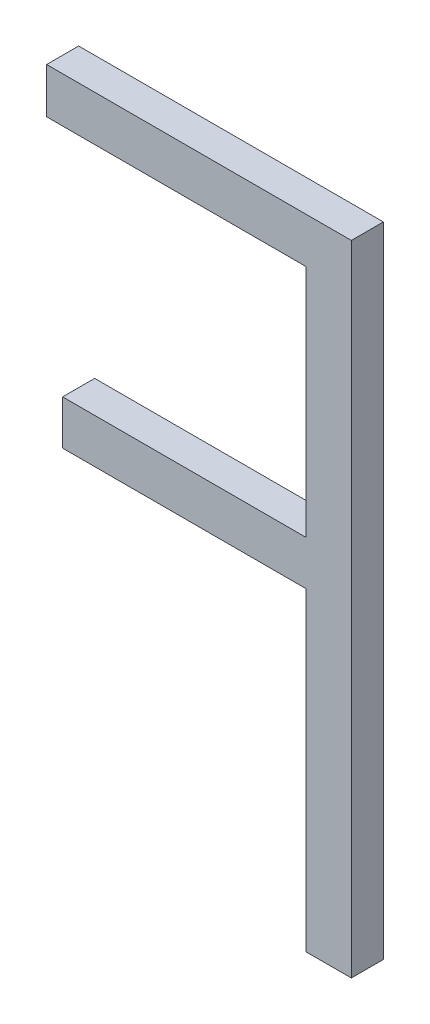
ISO-10303-21;
HEADER;
FILE_DESCRIPTION(('STEP AP214'),'2;1');
FILE_NAME('part.step','',(''),(''),'','','');
FILE_SCHEMA(('AUTOMOTIVE_DESIGN { 1 0 10303 214 1 1 1 1 }'));
ENDSEC;
DATA;
#1=APPLICATION_CONTEXT('core data for automotive mechanical design processes');
#2=APPLICATION_PROTOCOL_DEFINITION('international standard','automotive_design',2000,#1);
#3=PRODUCT_CONTEXT('',#1,'mechanical');
#4=PRODUCT('Part','Part','',(#3));
#5=PRODUCT_RELATED_PRODUCT_CATEGORY('part','',(#4));
#6=PRODUCT_DEFINITION_FORMATION('','',#4);
#7=PRODUCT_DEFINITION_CONTEXT('part definition',#1,'design');
#8=PRODUCT_DEFINITION('design','',#6,#7);
#9=PRODUCT_DEFINITION_SHAPE('','',#8);
#10=(LENGTH_UNIT() NAMED_UNIT(*) SI_UNIT(.MILLI.,.METRE.));
#11=(NAMED_UNIT(*) PLANE_ANGLE_UNIT() SI_UNIT($,.RADIAN.));
#12=(NAMED_UNIT(*) SI_UNIT($,.STERADIAN.) SOLID_ANGLE_UNIT());
#13=UNCERTAINTY_MEASURE_WITH_UNIT(LENGTH_MEASURE(1.E-05),#10,'distance_accuracy_value','');
#14=(GEOMETRIC_REPRESENTATION_CONTEXT(3) GLOBAL_UNCERTAINTY_ASSIGNED_CONTEXT((#13)) GLOBAL_UNIT_ASSIGNED_CONTEXT((#10,
#11,#12)) REPRESENTATION_CONTEXT('',''));
#15=CARTESIAN_POINT('',(0.,0.,0.));
#16=DIRECTION('',(0.,0.,1.));
#17=DIRECTION('',(1.,0.,0.));
#18=AXIS2_PLACEMENT_3D('',#15,#16,#17);
#19=CARTESIAN_POINT('',(72.4682702040903,67.6377070418411,-39.1));
#20=DIRECTION('',(0.,0.,1.));
#21=DIRECTION('',(1.,0.,0.));
#22=AXIS2_PLACEMENT_3D('',#19,#20,#21);
#23=PLANE('',#22);
#24=DIRECTION('',(1.,0.,0.));
#25=VECTOR('',#24,1.);
#26=CARTESIAN_POINT('',(72.4682702040903,67.7791772221511,-39.1));
#27=LINE('',#26,#25);
#28=CARTESIAN_POINT('',(73.4197265147903,67.7791772221511,-39.1));
#29=VERTEX_POINT('',#28);
#30=CARTESIAN_POINT('',(72.4682702040903,67.7791772221511,-39.1));
#31=VERTEX_POINT('',#30);
#32=EDGE_CURVE('E20',#29,#31,#27,.F.);
#33=ORIENTED_EDGE('',*,*,#32,.F.);
#34=DIRECTION('',(0.,1.,0.));
#35=VECTOR('',#34,1.);
#36=CARTESIAN_POINT('',(73.4197265147903,65.7847250723611,-39.1));
#37=LINE('',#36,#35);
#38=CARTESIAN_POINT('',(73.4197265147903,65.7847250723611,-39.1));
#39=VERTEX_POINT('',#38);
#40=EDGE_CURVE('E144',#29,#39,#37,.F.);
#41=ORIENTED_EDGE('',*,*,#40,.T.);
#42=DIRECTION('',(1.,0.,0.));
#43=VECTOR('',#42,1.);
#44=CARTESIAN_POINT('',(73.2782563344903,65.7847250723611,-39.1));
#45=LINE('',#44,#43);
#46=CARTESIAN_POINT('',(73.2782563344903,65.7847250723611,-39.1));
#47=VERTEX_POINT('',#46);
#48=EDGE_CURVE('E139',#39,#47,#45,.F.);
#49=ORIENTED_EDGE('',*,*,#48,.T.);
#50=DIRECTION('',(0.,1.,0.));
#51=VECTOR('',#50,1.);
#52=CARTESIAN_POINT('',(73.2782563344903,66.7666945591811,-39.1));
#53=LINE('',#52,#51);
#54=CARTESIAN_POINT('',(73.2782563344903,66.7666945591811,-39.1));
#55=VERTEX_POINT('',#54);
#56=EDGE_CURVE('E134',#47,#55,#53,.T.);
#57=ORIENTED_EDGE('',*,*,#56,.T.);
#58=DIRECTION('',(1.,0.,0.));
#59=VECTOR('',#58,1.);
#60=CARTESIAN_POINT('',(72.5182008559903,66.7666945591811,-39.1));
#61=LINE('',#60,#59);
#62=CARTESIAN_POINT('',(72.5182008559903,66.7666945591811,-39.1));
#63=VERTEX_POINT('',#62);
#64=EDGE_CURVE('E129',#55,#63,#61,.F.);
#65=ORIENTED_EDGE('',*,*,#64,.T.);
#66=DIRECTION('',(0.,1.,0.));
#67=VECTOR('',#66,1.);
#68=CARTESIAN_POINT('',(72.5182008559903,66.9053908143811,-39.1));
#69=LINE('',#68,#67);
#70=CARTESIAN_POINT('',(72.5182008559903,66.9053908143811,-39.1));
#71=VERTEX_POINT('',#70);
#72=EDGE_CURVE('E124',#63,#71,#69,.T.);
#73=ORIENTED_EDGE('',*,*,#72,.T.);
#74=DIRECTION('',(1.,0.,0.));
#75=VECTOR('',#74,1.);
#76=CARTESIAN_POINT('',(73.2782563344903,66.9053908143811,-39.1));
#77=LINE('',#76,#75);
#78=CARTESIAN_POINT('',(73.2782563344903,66.9053908143811,-39.1));
#79=VERTEX_POINT('',#78);
#80=EDGE_CURVE('E120',#71,#79,#77,.T.);
#81=ORIENTED_EDGE('',*,*,#80,.T.);
#82=DIRECTION('',(0.,1.,0.));
#83=VECTOR('',#82,1.);
#84=CARTESIAN_POINT('',(73.2782563344903,67.6377070418411,-39.1));
#85=LINE('',#84,#83);
#86=CARTESIAN_POINT('',(73.2782563344903,67.6377070418411,-39.1));
#87=VERTEX_POINT('',#86);
#88=EDGE_CURVE('E106',#79,#87,#85,.T.);
#89=ORIENTED_EDGE('',*,*,#88,.T.);
#90=DIRECTION('',(1.,0.,0.));
#91=VECTOR('',#90,1.);
#92=CARTESIAN_POINT('',(72.4682702040903,67.6377070418411,-39.1));
#93=LINE('',#92,#91);
#94=CARTESIAN_POINT('',(72.4682702040903,67.6377070418411,-39.1));
#95=VERTEX_POINT('',#94);
#96=EDGE_CURVE('E92',#87,#95,#93,.F.);
#97=ORIENTED_EDGE('',*,*,#96,.T.);
#98=DIRECTION('',(0.,1.,0.));
#99=VECTOR('',#98,1.);
#100=CARTESIAN_POINT('',(72.4682702040903,67.7791772221511,-39.1));
#101=LINE('',#100,#99);
#102=EDGE_CURVE('E98',#95,#31,#101,.T.);
#103=ORIENTED_EDGE('',*,*,#102,.T.);
#104=EDGE_LOOP('',(#33,#41,#49,#57,#65,#73,#81,#89,#97,#103));
#105=FACE_BOUND('',#104,.T.);
#106=ADVANCED_FACE('F17',(#105),#23,.F.);
#107=CARTESIAN_POINT('',(72.4682702040903,67.7791772221511,-39.));
#108=DIRECTION('',(1.,0.,0.));
#109=DIRECTION('',(0.,0.,-1.));
#110=AXIS2_PLACEMENT_3D('',#107,#108,#109);
#111=PLANE('',#110);
#112=DIRECTION('',(0.,0.,1.));
#113=VECTOR('',#112,1.);
#114=CARTESIAN_POINT('',(72.4682702040903,67.6377070418411,-39.));
#115=LINE('',#114,#113);
#116=CARTESIAN_POINT('',(72.4682702040903,67.6377070418411,-39.));
#117=VERTEX_POINT('',#116);
#118=EDGE_CURVE('E100',#95,#117,#115,.T.);
#119=ORIENTED_EDGE('',*,*,#118,.T.);
#120=DIRECTION('',(0.,1.,0.));
#121=VECTOR('',#120,1.);
#122=CARTESIAN_POINT('',(72.4682702040903,67.6377070418411,-39.));
#123=LINE('',#122,#121);
#124=CARTESIAN_POINT('',(72.4682702040903,67.7791772221511,-39.));
#125=VERTEX_POINT('',#124);
#126=EDGE_CURVE('E149',#125,#117,#123,.F.);
#127=ORIENTED_EDGE('',*,*,#126,.F.);
#128=DIRECTION('',(0.,0.,-1.));
#129=VECTOR('',#128,1.);
#130=CARTESIAN_POINT('',(72.4682702040903,67.7791772221511,-39.));
#131=LINE('',#130,#129);
#132=EDGE_CURVE('E103',#125,#31,#131,.T.);
#133=ORIENTED_EDGE('',*,*,#132,.T.);
#134=ORIENTED_EDGE('',*,*,#102,.F.);
#135=EDGE_LOOP('',(#119,#127,#133,#134));
#136=FACE_BOUND('',#135,.T.);
#137=ADVANCED_FACE('F99',(#136),#111,.F.);
#138=CARTESIAN_POINT('',(72.4682702040903,67.6377070418411,-39.));
#139=DIRECTION('',(0.,1.,0.));
#140=DIRECTION('',(0.,0.,1.));
#141=AXIS2_PLACEMENT_3D('',#138,#139,#140);
#142=PLANE('',#141);
#143=DIRECTION('',(0.,0.,-1.));
#144=VECTOR('',#143,1.);
#145=CARTESIAN_POINT('',(73.2782563344903,67.6377070418411,-39.));
#146=LINE('',#145,#144);
#147=CARTESIAN_POINT('',(73.2782563344903,67.6377070418411,-39.));
#148=VERTEX_POINT('',#147);
#149=EDGE_CURVE('E108',#87,#148,#146,.F.);
#150=ORIENTED_EDGE('',*,*,#149,.T.);
#151=DIRECTION('',(1.,0.,0.));
#152=VECTOR('',#151,1.);
#153=CARTESIAN_POINT('',(72.4682702040903,67.6377070418411,-39.));
#154=LINE('',#153,#152);
#155=EDGE_CURVE('E112',#117,#148,#154,.T.);
#156=ORIENTED_EDGE('',*,*,#155,.F.);
#157=ORIENTED_EDGE('',*,*,#118,.F.);
#158=ORIENTED_EDGE('',*,*,#96,.F.);
#159=EDGE_LOOP('',(#150,#156,#157,#158));
#160=FACE_BOUND('',#159,.T.);
#161=ADVANCED_FACE('F110',(#160),#142,.F.);
#162=CARTESIAN_POINT('',(73.2782563344903,67.6377070418411,-39.));
#163=DIRECTION('',(1.,0.,0.));
#164=DIRECTION('',(0.,0.,-1.));
#165=AXIS2_PLACEMENT_3D('',#162,#163,#164);
#166=PLANE('',#165);
#167=DIRECTION('',(0.,0.,-1.));
#168=VECTOR('',#167,1.);
#169=CARTESIAN_POINT('',(73.2782563344903,66.9053908143811,-39.));
#170=LINE('',#169,#168);
#171=CARTESIAN_POINT('',(73.2782563344903,66.9053908143811,-39.));
#172=VERTEX_POINT('',#171);
#173=EDGE_CURVE('E118',#79,#172,#170,.F.);
#174=ORIENTED_EDGE('',*,*,#173,.T.);
#175=DIRECTION('',(0.,1.,0.));
#176=VECTOR('',#175,1.);
#177=CARTESIAN_POINT('',(73.2782563344903,67.6377070418411,-39.));
#178=LINE('',#177,#176);
#179=EDGE_CURVE('E152',#148,#172,#178,.F.);
#180=ORIENTED_EDGE('',*,*,#179,.F.);
#181=ORIENTED_EDGE('',*,*,#149,.F.);
#182=ORIENTED_EDGE('',*,*,#88,.F.);
#183=EDGE_LOOP('',(#174,#180,#181,#182));
#184=FACE_BOUND('',#183,.T.);
#185=ADVANCED_FACE('F208',(#184),#166,.F.);
#186=CARTESIAN_POINT('',(73.2782563344903,66.9053908143811,-39.));
#187=DIRECTION('',(0.,-1.,0.));
#188=DIRECTION('',(0.,0.,-1.));
#189=AXIS2_PLACEMENT_3D('',#186,#187,#188);
#190=PLANE('',#189);
#191=DIRECTION('',(0.,0.,-1.));
#192=VECTOR('',#191,1.);
#193=CARTESIAN_POINT('',(72.5182008559903,66.9053908143811,-39.));
#194=LINE('',#193,#192);
#195=CARTESIAN_POINT('',(72.5182008559903,66.9053908143811,-39.));
#196=VERTEX_POINT('',#195);
#197=EDGE_CURVE('E122',#71,#196,#194,.F.);
#198=ORIENTED_EDGE('',*,*,#197,.T.);
#199=DIRECTION('',(1.,0.,0.));
#200=VECTOR('',#199,1.);
#201=CARTESIAN_POINT('',(72.4682702040903,66.9053908143811,-39.));
#202=LINE('',#201,#200);
#203=EDGE_CURVE('E155',#172,#196,#202,.F.);
#204=ORIENTED_EDGE('',*,*,#203,.F.);
#205=ORIENTED_EDGE('',*,*,#173,.F.);
#206=ORIENTED_EDGE('',*,*,#80,.F.);
#207=EDGE_LOOP('',(#198,#204,#205,#206));
#208=FACE_BOUND('',#207,.T.);
#209=ADVANCED_FACE('F204',(#208),#190,.F.);
#210=CARTESIAN_POINT('',(72.5182008559903,66.9053908143811,-39.));
#211=DIRECTION('',(1.,0.,0.));
#212=DIRECTION('',(0.,0.,-1.));
#213=AXIS2_PLACEMENT_3D('',#210,#211,#212);
#214=PLANE('',#213);
#215=DIRECTION('',(0.,0.,1.));
#216=VECTOR('',#215,1.);
#217=CARTESIAN_POINT('',(72.5182008559903,66.7666945591811,-39.));
#218=LINE('',#217,#216);
#219=CARTESIAN_POINT('',(72.5182008559903,66.7666945591811,-39.));
#220=VERTEX_POINT('',#219);
#221=EDGE_CURVE('E127',#63,#220,#218,.T.);
#222=ORIENTED_EDGE('',*,*,#221,.T.);
#223=DIRECTION('',(0.,1.,0.));
#224=VECTOR('',#223,1.);
#225=CARTESIAN_POINT('',(72.5182008559903,67.6377070418411,-39.));
#226=LINE('',#225,#224);
#227=EDGE_CURVE('E158',#196,#220,#226,.F.);
#228=ORIENTED_EDGE('',*,*,#227,.F.);
#229=ORIENTED_EDGE('',*,*,#197,.F.);
#230=ORIENTED_EDGE('',*,*,#72,.F.);
#231=EDGE_LOOP('',(#222,#228,#229,#230));
#232=FACE_BOUND('',#231,.T.);
#233=ADVANCED_FACE('F200',(#232),#214,.F.);
#234=CARTESIAN_POINT('',(72.5182008559903,66.7666945591811,-39.));
#235=DIRECTION('',(0.,1.,0.));
#236=DIRECTION('',(0.,0.,1.));
#237=AXIS2_PLACEMENT_3D('',#234,#235,#236);
#238=PLANE('',#237);
#239=DIRECTION('',(0.,0.,-1.));
#240=VECTOR('',#239,1.);
#241=CARTESIAN_POINT('',(73.2782563344903,66.7666945591811,-39.));
#242=LINE('',#241,#240);
#243=CARTESIAN_POINT('',(73.2782563344903,66.7666945591811,-39.));
#244=VERTEX_POINT('',#243);
#245=EDGE_CURVE('E132',#55,#244,#242,.F.);
#246=ORIENTED_EDGE('',*,*,#245,.T.);
#247=DIRECTION('',(1.,0.,0.));
#248=VECTOR('',#247,1.);
#249=CARTESIAN_POINT('',(72.4682702040903,66.7666945591811,-39.));
#250=LINE('',#249,#248);
#251=EDGE_CURVE('E161',#220,#244,#250,.T.);
#252=ORIENTED_EDGE('',*,*,#251,.F.);
#253=ORIENTED_EDGE('',*,*,#221,.F.);
#254=ORIENTED_EDGE('',*,*,#64,.F.);
#255=EDGE_LOOP('',(#246,#252,#253,#254));
#256=FACE_BOUND('',#255,.T.);
#257=ADVANCED_FACE('F196',(#256),#238,.F.);
#258=CARTESIAN_POINT('',(73.2782563344903,66.7666945591811,-39.));
#259=DIRECTION('',(1.,0.,0.));
#260=DIRECTION('',(0.,0.,-1.));
#261=AXIS2_PLACEMENT_3D('',#258,#259,#260);
#262=PLANE('',#261);
#263=DIRECTION('',(0.,0.,1.));
#264=VECTOR('',#263,1.);
#265=CARTESIAN_POINT('',(73.2782563344903,65.7847250723611,-39.));
#266=LINE('',#265,#264);
#267=CARTESIAN_POINT('',(73.2782563344903,65.7847250723611,-39.));
#268=VERTEX_POINT('',#267);
#269=EDGE_CURVE('E137',#47,#268,#266,.T.);
#270=ORIENTED_EDGE('',*,*,#269,.T.);
#271=DIRECTION('',(0.,1.,0.));
#272=VECTOR('',#271,1.);
#273=CARTESIAN_POINT('',(73.2782563344903,67.6377070418411,-39.));
#274=LINE('',#273,#272);
#275=EDGE_CURVE('E164',#244,#268,#274,.F.);
#276=ORIENTED_EDGE('',*,*,#275,.F.);
#277=ORIENTED_EDGE('',*,*,#245,.F.);
#278=ORIENTED_EDGE('',*,*,#56,.F.);
#279=EDGE_LOOP('',(#270,#276,#277,#278));
#280=FACE_BOUND('',#279,.T.);
#281=ADVANCED_FACE('F193',(#280),#262,.F.);
#282=CARTESIAN_POINT('',(73.2782563344903,65.7847250723611,-39.));
#283=DIRECTION('',(0.,1.,0.));
#284=DIRECTION('',(0.,0.,1.));
#285=AXIS2_PLACEMENT_3D('',#282,#283,#284);
#286=PLANE('',#285);
#287=DIRECTION('',(0.,0.,1.));
#288=VECTOR('',#287,1.);
#289=CARTESIAN_POINT('',(73.4197265147903,65.7847250723611,-39.));
#290=LINE('',#289,#288);
#291=CARTESIAN_POINT('',(73.4197265147903,65.7847250723611,-39.));
#292=VERTEX_POINT('',#291);
#293=EDGE_CURVE('E142',#39,#292,#290,.T.);
#294=ORIENTED_EDGE('',*,*,#293,.T.);
#295=DIRECTION('',(1.,0.,0.));
#296=VECTOR('',#295,1.);
#297=CARTESIAN_POINT('',(72.4682702040903,65.7847250723611,-39.));
#298=LINE('',#297,#296);
#299=EDGE_CURVE('E167',#268,#292,#298,.T.);
#300=ORIENTED_EDGE('',*,*,#299,.F.);
#301=ORIENTED_EDGE('',*,*,#269,.F.);
#302=ORIENTED_EDGE('',*,*,#48,.F.);
#303=EDGE_LOOP('',(#294,#300,#301,#302));
#304=FACE_BOUND('',#303,.T.);
#305=ADVANCED_FACE('F177',(#304),#286,.F.);
#306=CARTESIAN_POINT('',(73.4197265147903,65.7847250723611,-39.));
#307=DIRECTION('',(-1.,0.,0.));
#308=DIRECTION('',(0.,0.,1.));
#309=AXIS2_PLACEMENT_3D('',#306,#307,#308);
#310=PLANE('',#309);
#311=DIRECTION('',(0.,0.,-1.));
#312=VECTOR('',#311,1.);
#313=CARTESIAN_POINT('',(73.4197265147903,67.7791772221511,-39.));
#314=LINE('',#313,#312);
#315=CARTESIAN_POINT('',(73.4197265147903,67.7791772221511,-39.));
#316=VERTEX_POINT('',#315);
#317=EDGE_CURVE('E35',#29,#316,#314,.F.);
#318=ORIENTED_EDGE('',*,*,#317,.T.);
#319=DIRECTION('',(0.,1.,0.));
#320=VECTOR('',#319,1.);
#321=CARTESIAN_POINT('',(73.4197265147903,67.6377070418411,-39.));
#322=LINE('',#321,#320);
#323=EDGE_CURVE('E26',#292,#316,#322,.T.);
#324=ORIENTED_EDGE('',*,*,#323,.F.);
#325=ORIENTED_EDGE('',*,*,#293,.F.);
#326=ORIENTED_EDGE('',*,*,#40,.F.);
#327=EDGE_LOOP('',(#318,#324,#325,#326));
#328=FACE_BOUND('',#327,.T.);
#329=ADVANCED_FACE('F175',(#328),#310,.F.);
#330=CARTESIAN_POINT('',(73.4197265147903,67.7791772221511,-39.));
#331=DIRECTION('',(0.,-1.,0.));
#332=DIRECTION('',(0.,0.,-1.));
#333=AXIS2_PLACEMENT_3D('',#330,#331,#332);
#334=PLANE('',#333);
#335=ORIENTED_EDGE('',*,*,#132,.F.);
#336=DIRECTION('',(1.,0.,0.));
#337=VECTOR('',#336,1.);
#338=CARTESIAN_POINT('',(72.4682702040903,67.7791772221511,-39.));
#339=LINE('',#338,#337);
#340=EDGE_CURVE('E11',#316,#125,#339,.F.);
#341=ORIENTED_EDGE('',*,*,#340,.F.);
#342=ORIENTED_EDGE('',*,*,#317,.F.);
#343=ORIENTED_EDGE('',*,*,#32,.T.);
#344=EDGE_LOOP('',(#335,#341,#342,#343));
#345=FACE_BOUND('',#344,.T.);
#346=ADVANCED_FACE('F180',(#345),#334,.F.);
#347=CARTESIAN_POINT('',(72.4682702040903,67.6377070418411,-39.));
#348=DIRECTION('',(0.,0.,1.));
#349=DIRECTION('',(1.,0.,0.));
#350=AXIS2_PLACEMENT_3D('',#347,#348,#349);
#351=PLANE('',#350);
#352=ORIENTED_EDGE('',*,*,#323,.T.);
#353=ORIENTED_EDGE('',*,*,#340,.T.);
#354=ORIENTED_EDGE('',*,*,#126,.T.);
#355=ORIENTED_EDGE('',*,*,#155,.T.);
#356=ORIENTED_EDGE('',*,*,#179,.T.);
#357=ORIENTED_EDGE('',*,*,#203,.T.);
#358=ORIENTED_EDGE('',*,*,#227,.T.);
#359=ORIENTED_EDGE('',*,*,#251,.T.);
#360=ORIENTED_EDGE('',*,*,#275,.T.);
#361=ORIENTED_EDGE('',*,*,#299,.T.);
#362=EDGE_LOOP('',(#352,#353,#354,#355,#356,#357,#358,#359,#360,#361));
#363=FACE_BOUND('',#362,.T.);
#364=ADVANCED_FACE('F172',(#363),#351,.T.);
#365=CLOSED_SHELL('',(#106,#137,#161,#185,#209,#233,#257,#281,#305,#329,#346,#364));
#366=MANIFOLD_SOLID_BREP('B1',#365);
#367=ADVANCED_BREP_SHAPE_REPRESENTATION('',(#18,#366),#14);
#368=SHAPE_DEFINITION_REPRESENTATION(#9,#367);
ENDSEC;
END-ISO-10303-21;
